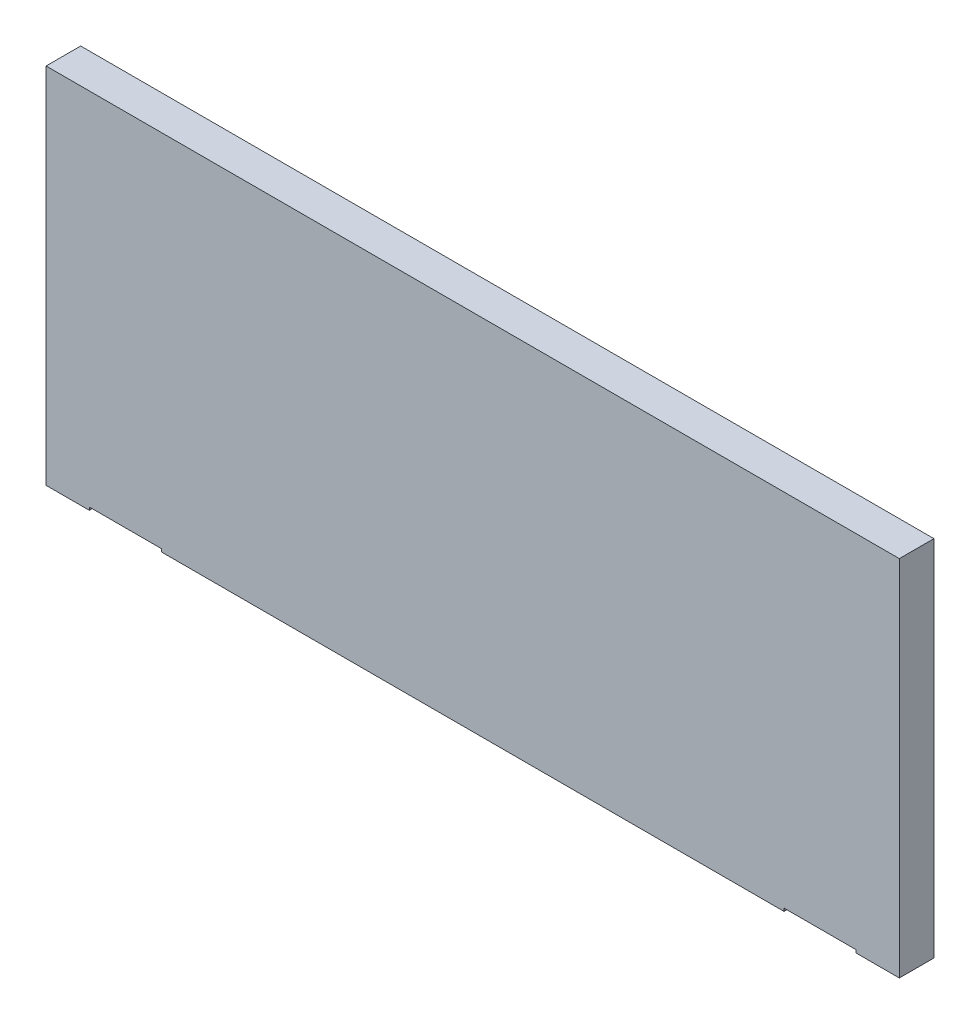
ISO-10303-21;
HEADER;
FILE_DESCRIPTION(('STEP AP214'),'2;1');
FILE_NAME('part.step','',(''),(''),'','','');
FILE_SCHEMA(('AUTOMOTIVE_DESIGN { 1 0 10303 214 1 1 1 1 }'));
ENDSEC;
DATA;
#1=APPLICATION_CONTEXT('core data for automotive mechanical design processes');
#2=APPLICATION_PROTOCOL_DEFINITION('international standard','automotive_design',2000,#1);
#3=PRODUCT_CONTEXT('',#1,'mechanical');
#4=PRODUCT('Part','Part','',(#3));
#5=PRODUCT_RELATED_PRODUCT_CATEGORY('part','',(#4));
#6=PRODUCT_DEFINITION_FORMATION('','',#4);
#7=PRODUCT_DEFINITION_CONTEXT('part definition',#1,'design');
#8=PRODUCT_DEFINITION('design','',#6,#7);
#9=PRODUCT_DEFINITION_SHAPE('','',#8);
#10=(LENGTH_UNIT() NAMED_UNIT(*) SI_UNIT(.MILLI.,.METRE.));
#11=(NAMED_UNIT(*) PLANE_ANGLE_UNIT() SI_UNIT($,.RADIAN.));
#12=(NAMED_UNIT(*) SI_UNIT($,.STERADIAN.) SOLID_ANGLE_UNIT());
#13=UNCERTAINTY_MEASURE_WITH_UNIT(LENGTH_MEASURE(1.E-05),#10,'distance_accuracy_value','');
#14=(GEOMETRIC_REPRESENTATION_CONTEXT(3) GLOBAL_UNCERTAINTY_ASSIGNED_CONTEXT((#13)) GLOBAL_UNIT_ASSIGNED_CONTEXT((#10,
#11,#12)) REPRESENTATION_CONTEXT('',''));
#15=CARTESIAN_POINT('',(0.,0.,0.));
#16=DIRECTION('',(0.,0.,1.));
#17=DIRECTION('',(1.,0.,0.));
#18=AXIS2_PLACEMENT_3D('',#15,#16,#17);
#19=CARTESIAN_POINT('',(0.,0.,12.));
#20=DIRECTION('',(0.,1.,0.));
#21=DIRECTION('',(0.,0.,1.));
#22=AXIS2_PLACEMENT_3D('',#19,#20,#21);
#23=PLANE('',#22);
#24=DIRECTION('',(0.,0.,1.));
#25=VECTOR('',#24,1.);
#26=CARTESIAN_POINT('',(256.,0.,12.));
#27=LINE('',#26,#25);
#28=CARTESIAN_POINT('',(256.,0.,0.));
#29=VERTEX_POINT('',#28);
#30=CARTESIAN_POINT('',(256.,0.,12.));
#31=VERTEX_POINT('',#30);
#32=EDGE_CURVE('E326',#29,#31,#27,.T.);
#33=ORIENTED_EDGE('',*,*,#32,.T.);
#34=DIRECTION('',(1.,0.,0.));
#35=VECTOR('',#34,1.);
#36=CARTESIAN_POINT('',(0.,0.,12.));
#37=LINE('',#36,#35);
#38=CARTESIAN_POINT('',(40.,0.,12.));
#39=VERTEX_POINT('',#38);
#40=EDGE_CURVE('E144',#39,#31,#37,.T.);
#41=ORIENTED_EDGE('',*,*,#40,.F.);
#42=DIRECTION('',(0.,0.,-1.));
#43=VECTOR('',#42,1.);
#44=CARTESIAN_POINT('',(40.,0.,12.));
#45=LINE('',#44,#43);
#46=CARTESIAN_POINT('',(40.,0.,0.));
#47=VERTEX_POINT('',#46);
#48=EDGE_CURVE('E158',#39,#47,#45,.T.);
#49=ORIENTED_EDGE('',*,*,#48,.T.);
#50=DIRECTION('',(1.,0.,0.));
#51=VECTOR('',#50,1.);
#52=CARTESIAN_POINT('',(0.,0.,0.));
#53=LINE('',#52,#51);
#54=EDGE_CURVE('E216',#47,#29,#53,.T.);
#55=ORIENTED_EDGE('',*,*,#54,.T.);
#56=EDGE_LOOP('',(#33,#41,#49,#55));
#57=FACE_BOUND('',#56,.T.);
#58=ADVANCED_FACE('F32',(#57),#23,.F.);
#59=DIRECTION('',(0.,0.,-1.));
#60=VECTOR('',#59,1.);
#61=CARTESIAN_POINT('',(281.,0.,12.));
#62=LINE('',#61,#60);
#63=CARTESIAN_POINT('',(281.,0.,12.));
#64=VERTEX_POINT('',#63);
#65=CARTESIAN_POINT('',(281.,0.,0.));
#66=VERTEX_POINT('',#65);
#67=EDGE_CURVE('E138',#64,#66,#62,.T.);
#68=ORIENTED_EDGE('',*,*,#67,.T.);
#69=CARTESIAN_POINT('',(296.,0.,0.));
#70=VERTEX_POINT('',#69);
#71=EDGE_CURVE('E211',#66,#70,#53,.T.);
#72=ORIENTED_EDGE('',*,*,#71,.T.);
#73=DIRECTION('',(0.,0.,-1.));
#74=VECTOR('',#73,1.);
#75=CARTESIAN_POINT('',(296.,0.,12.));
#76=LINE('',#75,#74);
#77=CARTESIAN_POINT('',(296.,0.,12.));
#78=VERTEX_POINT('',#77);
#79=EDGE_CURVE('E41',#78,#70,#76,.T.);
#80=ORIENTED_EDGE('',*,*,#79,.F.);
#81=EDGE_CURVE('E199',#64,#78,#37,.T.);
#82=ORIENTED_EDGE('',*,*,#81,.F.);
#83=EDGE_LOOP('',(#68,#72,#80,#82));
#84=FACE_BOUND('',#83,.T.);
#85=ADVANCED_FACE('F249',(#84),#23,.F.);
#86=CARTESIAN_POINT('',(0.,0.,12.));
#87=DIRECTION('',(0.,0.,-1.));
#88=DIRECTION('',(-1.,0.,0.));
#89=AXIS2_PLACEMENT_3D('',#86,#87,#88);
#90=PLANE('',#89);
#91=DIRECTION('',(0.,-1.,0.));
#92=VECTOR('',#91,1.);
#93=CARTESIAN_POINT('',(256.,1.,12.));
#94=LINE('',#93,#92);
#95=CARTESIAN_POINT('',(256.,1.,12.));
#96=VERTEX_POINT('',#95);
#97=EDGE_CURVE('E133',#96,#31,#94,.T.);
#98=ORIENTED_EDGE('',*,*,#97,.F.);
#99=DIRECTION('',(1.,0.,0.));
#100=VECTOR('',#99,1.);
#101=CARTESIAN_POINT('',(256.,1.,12.));
#102=LINE('',#101,#100);
#103=CARTESIAN_POINT('',(281.,1.,12.));
#104=VERTEX_POINT('',#103);
#105=EDGE_CURVE('E124',#96,#104,#102,.T.);
#106=ORIENTED_EDGE('',*,*,#105,.T.);
#107=DIRECTION('',(0.,-1.,0.));
#108=VECTOR('',#107,1.);
#109=CARTESIAN_POINT('',(281.,1.,12.));
#110=LINE('',#109,#108);
#111=EDGE_CURVE('E145',#104,#64,#110,.T.);
#112=ORIENTED_EDGE('',*,*,#111,.T.);
#113=ORIENTED_EDGE('',*,*,#81,.T.);
#114=DIRECTION('',(0.,1.,0.));
#115=VECTOR('',#114,1.);
#116=CARTESIAN_POINT('',(296.,0.,12.));
#117=LINE('',#116,#115);
#118=CARTESIAN_POINT('',(296.,126.,12.));
#119=VERTEX_POINT('',#118);
#120=EDGE_CURVE('E204',#78,#119,#117,.T.);
#121=ORIENTED_EDGE('',*,*,#120,.T.);
#122=DIRECTION('',(-1.,0.,0.));
#123=VECTOR('',#122,1.);
#124=CARTESIAN_POINT('',(0.,126.,12.));
#125=LINE('',#124,#123);
#126=CARTESIAN_POINT('',(0.,126.,12.));
#127=VERTEX_POINT('',#126);
#128=EDGE_CURVE('E206',#119,#127,#125,.T.);
#129=ORIENTED_EDGE('',*,*,#128,.T.);
#130=DIRECTION('',(0.,-1.,0.));
#131=VECTOR('',#130,1.);
#132=CARTESIAN_POINT('',(0.,0.,12.));
#133=LINE('',#132,#131);
#134=CARTESIAN_POINT('',(0.,0.,12.));
#135=VERTEX_POINT('',#134);
#136=EDGE_CURVE('E196',#127,#135,#133,.T.);
#137=ORIENTED_EDGE('',*,*,#136,.T.);
#138=CARTESIAN_POINT('',(15.,0.,12.));
#139=VERTEX_POINT('',#138);
#140=EDGE_CURVE('E201',#135,#139,#37,.T.);
#141=ORIENTED_EDGE('',*,*,#140,.T.);
#142=DIRECTION('',(0.,-1.,0.));
#143=VECTOR('',#142,1.);
#144=CARTESIAN_POINT('',(15.,1.,12.));
#145=LINE('',#144,#143);
#146=CARTESIAN_POINT('',(15.,1.,12.));
#147=VERTEX_POINT('',#146);
#148=EDGE_CURVE('E177',#147,#139,#145,.T.);
#149=ORIENTED_EDGE('',*,*,#148,.F.);
#150=DIRECTION('',(1.,0.,0.));
#151=VECTOR('',#150,1.);
#152=CARTESIAN_POINT('',(15.,1.,12.));
#153=LINE('',#152,#151);
#154=CARTESIAN_POINT('',(40.,1.,12.));
#155=VERTEX_POINT('',#154);
#156=EDGE_CURVE('E157',#147,#155,#153,.T.);
#157=ORIENTED_EDGE('',*,*,#156,.T.);
#158=DIRECTION('',(0.,-1.,0.));
#159=VECTOR('',#158,1.);
#160=CARTESIAN_POINT('',(40.,1.,12.));
#161=LINE('',#160,#159);
#162=EDGE_CURVE('E175',#155,#39,#161,.T.);
#163=ORIENTED_EDGE('',*,*,#162,.T.);
#164=ORIENTED_EDGE('',*,*,#40,.T.);
#165=EDGE_LOOP('',(#98,#106,#112,#113,#121,#129,#137,#141,#149,#157,#163,#164));
#166=FACE_BOUND('',#165,.T.);
#167=ADVANCED_FACE('F141',(#166),#90,.F.);
#168=CARTESIAN_POINT('',(0.,0.,0.));
#169=DIRECTION('',(0.,0.,-1.));
#170=DIRECTION('',(-1.,0.,0.));
#171=AXIS2_PLACEMENT_3D('',#168,#169,#170);
#172=PLANE('',#171);
#173=DIRECTION('',(-1.,0.,0.));
#174=VECTOR('',#173,1.);
#175=CARTESIAN_POINT('',(256.,1.,0.));
#176=LINE('',#175,#174);
#177=CARTESIAN_POINT('',(281.,1.,0.));
#178=VERTEX_POINT('',#177);
#179=CARTESIAN_POINT('',(256.,1.,0.));
#180=VERTEX_POINT('',#179);
#181=EDGE_CURVE('E327',#178,#180,#176,.T.);
#182=ORIENTED_EDGE('',*,*,#181,.T.);
#183=DIRECTION('',(0.,-1.,0.));
#184=VECTOR('',#183,1.);
#185=CARTESIAN_POINT('',(256.,1.,0.));
#186=LINE('',#185,#184);
#187=EDGE_CURVE('E136',#180,#29,#186,.T.);
#188=ORIENTED_EDGE('',*,*,#187,.T.);
#189=ORIENTED_EDGE('',*,*,#54,.F.);
#190=DIRECTION('',(0.,-1.,0.));
#191=VECTOR('',#190,1.);
#192=CARTESIAN_POINT('',(40.,1.,0.));
#193=LINE('',#192,#191);
#194=CARTESIAN_POINT('',(40.,1.,0.));
#195=VERTEX_POINT('',#194);
#196=EDGE_CURVE('E173',#195,#47,#193,.T.);
#197=ORIENTED_EDGE('',*,*,#196,.F.);
#198=DIRECTION('',(-1.,0.,0.));
#199=VECTOR('',#198,1.);
#200=CARTESIAN_POINT('',(15.,1.,0.));
#201=LINE('',#200,#199);
#202=CARTESIAN_POINT('',(15.,1.,0.));
#203=VERTEX_POINT('',#202);
#204=EDGE_CURVE('E163',#195,#203,#201,.T.);
#205=ORIENTED_EDGE('',*,*,#204,.T.);
#206=DIRECTION('',(0.,-1.,0.));
#207=VECTOR('',#206,1.);
#208=CARTESIAN_POINT('',(15.,1.,0.));
#209=LINE('',#208,#207);
#210=CARTESIAN_POINT('',(15.,0.,0.));
#211=VERTEX_POINT('',#210);
#212=EDGE_CURVE('E166',#203,#211,#209,.T.);
#213=ORIENTED_EDGE('',*,*,#212,.T.);
#214=CARTESIAN_POINT('',(0.,0.,0.));
#215=VERTEX_POINT('',#214);
#216=EDGE_CURVE('E212',#215,#211,#53,.T.);
#217=ORIENTED_EDGE('',*,*,#216,.F.);
#218=DIRECTION('',(0.,-1.,0.));
#219=VECTOR('',#218,1.);
#220=CARTESIAN_POINT('',(0.,0.,0.));
#221=LINE('',#220,#219);
#222=CARTESIAN_POINT('',(0.,126.,0.));
#223=VERTEX_POINT('',#222);
#224=EDGE_CURVE('E195',#223,#215,#221,.T.);
#225=ORIENTED_EDGE('',*,*,#224,.F.);
#226=DIRECTION('',(-1.,0.,0.));
#227=VECTOR('',#226,1.);
#228=CARTESIAN_POINT('',(0.,126.,0.));
#229=LINE('',#228,#227);
#230=CARTESIAN_POINT('',(296.,126.,0.));
#231=VERTEX_POINT('',#230);
#232=EDGE_CURVE('E200',#231,#223,#229,.T.);
#233=ORIENTED_EDGE('',*,*,#232,.F.);
#234=DIRECTION('',(0.,1.,0.));
#235=VECTOR('',#234,1.);
#236=CARTESIAN_POINT('',(296.,0.,0.));
#237=LINE('',#236,#235);
#238=EDGE_CURVE('E215',#70,#231,#237,.T.);
#239=ORIENTED_EDGE('',*,*,#238,.F.);
#240=ORIENTED_EDGE('',*,*,#71,.F.);
#241=DIRECTION('',(0.,-1.,0.));
#242=VECTOR('',#241,1.);
#243=CARTESIAN_POINT('',(281.,1.,0.));
#244=LINE('',#243,#242);
#245=EDGE_CURVE('E149',#178,#66,#244,.T.);
#246=ORIENTED_EDGE('',*,*,#245,.F.);
#247=EDGE_LOOP('',(#182,#188,#189,#197,#205,#213,#217,#225,#233,#239,#240,#246));
#248=FACE_BOUND('',#247,.T.);
#249=ADVANCED_FACE('F258',(#248),#172,.T.);
#250=DIRECTION('',(0.,0.,1.));
#251=VECTOR('',#250,1.);
#252=CARTESIAN_POINT('',(15.,0.,12.));
#253=LINE('',#252,#251);
#254=EDGE_CURVE('E155',#211,#139,#253,.T.);
#255=ORIENTED_EDGE('',*,*,#254,.T.);
#256=ORIENTED_EDGE('',*,*,#140,.F.);
#257=DIRECTION('',(0.,0.,-1.));
#258=VECTOR('',#257,1.);
#259=CARTESIAN_POINT('',(0.,0.,12.));
#260=LINE('',#259,#258);
#261=EDGE_CURVE('E11',#135,#215,#260,.T.);
#262=ORIENTED_EDGE('',*,*,#261,.T.);
#263=ORIENTED_EDGE('',*,*,#216,.T.);
#264=EDGE_LOOP('',(#255,#256,#262,#263));
#265=FACE_BOUND('',#264,.T.);
#266=ADVANCED_FACE('F251',(#265),#23,.F.);
#267=CARTESIAN_POINT('',(0.,0.,12.));
#268=DIRECTION('',(1.,0.,0.));
#269=DIRECTION('',(0.,0.,-1.));
#270=AXIS2_PLACEMENT_3D('',#267,#268,#269);
#271=PLANE('',#270);
#272=ORIENTED_EDGE('',*,*,#224,.T.);
#273=ORIENTED_EDGE('',*,*,#261,.F.);
#274=ORIENTED_EDGE('',*,*,#136,.F.);
#275=DIRECTION('',(0.,0.,-1.));
#276=VECTOR('',#275,1.);
#277=CARTESIAN_POINT('',(0.,126.,12.));
#278=LINE('',#277,#276);
#279=EDGE_CURVE('E208',#127,#223,#278,.T.);
#280=ORIENTED_EDGE('',*,*,#279,.T.);
#281=EDGE_LOOP('',(#272,#273,#274,#280));
#282=FACE_BOUND('',#281,.T.);
#283=ADVANCED_FACE('F34',(#282),#271,.F.);
#284=CARTESIAN_POINT('',(296.,0.,12.));
#285=DIRECTION('',(-1.,0.,0.));
#286=DIRECTION('',(0.,0.,1.));
#287=AXIS2_PLACEMENT_3D('',#284,#285,#286);
#288=PLANE('',#287);
#289=ORIENTED_EDGE('',*,*,#238,.T.);
#290=DIRECTION('',(0.,0.,-1.));
#291=VECTOR('',#290,1.);
#292=CARTESIAN_POINT('',(296.,126.,12.));
#293=LINE('',#292,#291);
#294=EDGE_CURVE('E221',#119,#231,#293,.T.);
#295=ORIENTED_EDGE('',*,*,#294,.F.);
#296=ORIENTED_EDGE('',*,*,#120,.F.);
#297=ORIENTED_EDGE('',*,*,#79,.T.);
#298=EDGE_LOOP('',(#289,#295,#296,#297));
#299=FACE_BOUND('',#298,.T.);
#300=ADVANCED_FACE('F264',(#299),#288,.F.);
#301=CARTESIAN_POINT('',(0.,126.,12.));
#302=DIRECTION('',(0.,-1.,0.));
#303=DIRECTION('',(0.,0.,-1.));
#304=AXIS2_PLACEMENT_3D('',#301,#302,#303);
#305=PLANE('',#304);
#306=ORIENTED_EDGE('',*,*,#232,.T.);
#307=ORIENTED_EDGE('',*,*,#279,.F.);
#308=ORIENTED_EDGE('',*,*,#128,.F.);
#309=ORIENTED_EDGE('',*,*,#294,.T.);
#310=EDGE_LOOP('',(#306,#307,#308,#309));
#311=FACE_BOUND('',#310,.T.);
#312=ADVANCED_FACE('F279',(#311),#305,.F.);
#313=CARTESIAN_POINT('',(15.,1.,12.));
#314=DIRECTION('',(1.,0.,0.));
#315=DIRECTION('',(0.,0.,-1.));
#316=AXIS2_PLACEMENT_3D('',#313,#314,#315);
#317=PLANE('',#316);
#318=ORIENTED_EDGE('',*,*,#254,.F.);
#319=ORIENTED_EDGE('',*,*,#212,.F.);
#320=DIRECTION('',(0.,0.,1.));
#321=VECTOR('',#320,1.);
#322=CARTESIAN_POINT('',(15.,1.,12.));
#323=LINE('',#322,#321);
#324=EDGE_CURVE('E57',#203,#147,#323,.T.);
#325=ORIENTED_EDGE('',*,*,#324,.T.);
#326=ORIENTED_EDGE('',*,*,#148,.T.);
#327=EDGE_LOOP('',(#318,#319,#325,#326));
#328=FACE_BOUND('',#327,.T.);
#329=ADVANCED_FACE('F243',(#328),#317,.T.);
#330=CARTESIAN_POINT('',(40.,1.,12.));
#331=DIRECTION('',(-1.,0.,0.));
#332=DIRECTION('',(0.,0.,1.));
#333=AXIS2_PLACEMENT_3D('',#330,#331,#332);
#334=PLANE('',#333);
#335=ORIENTED_EDGE('',*,*,#48,.F.);
#336=ORIENTED_EDGE('',*,*,#162,.F.);
#337=DIRECTION('',(0.,0.,-1.));
#338=VECTOR('',#337,1.);
#339=CARTESIAN_POINT('',(40.,1.,12.));
#340=LINE('',#339,#338);
#341=EDGE_CURVE('E161',#155,#195,#340,.T.);
#342=ORIENTED_EDGE('',*,*,#341,.T.);
#343=ORIENTED_EDGE('',*,*,#196,.T.);
#344=EDGE_LOOP('',(#335,#336,#342,#343));
#345=FACE_BOUND('',#344,.T.);
#346=ADVANCED_FACE('F233',(#345),#334,.T.);
#347=CARTESIAN_POINT('',(0.,1.,0.));
#348=DIRECTION('',(0.,-1.,0.));
#349=DIRECTION('',(0.,0.,-1.));
#350=AXIS2_PLACEMENT_3D('',#347,#348,#349);
#351=PLANE('',#350);
#352=CARTESIAN_POINT('',(21.,0.999999999999999,6.));
#353=DIRECTION('',(0.,-1.,0.));
#354=DIRECTION('',(0.,0.,-1.));
#355=AXIS2_PLACEMENT_3D('',#352,#353,#354);
#356=CIRCLE('',#355,1.5);
#357=CARTESIAN_POINT('',(21.,0.999999999999999,4.5));
#358=VERTEX_POINT('',#357);
#359=EDGE_CURVE('E180',#358,#358,#356,.T.);
#360=ORIENTED_EDGE('',*,*,#359,.F.);
#361=EDGE_LOOP('',(#360));
#362=FACE_BOUND('',#361,.T.);
#363=CARTESIAN_POINT('',(34.,0.999999999999999,6.));
#364=DIRECTION('',(0.,-1.,0.));
#365=DIRECTION('',(0.,0.,-1.));
#366=AXIS2_PLACEMENT_3D('',#363,#364,#365);
#367=CIRCLE('',#366,1.5);
#368=CARTESIAN_POINT('',(34.,0.999999999999999,4.5));
#369=VERTEX_POINT('',#368);
#370=EDGE_CURVE('E179',#369,#369,#367,.T.);
#371=ORIENTED_EDGE('',*,*,#370,.F.);
#372=EDGE_LOOP('',(#371));
#373=FACE_BOUND('',#372,.T.);
#374=ORIENTED_EDGE('',*,*,#324,.F.);
#375=ORIENTED_EDGE('',*,*,#204,.F.);
#376=ORIENTED_EDGE('',*,*,#341,.F.);
#377=ORIENTED_EDGE('',*,*,#156,.F.);
#378=EDGE_LOOP('',(#374,#375,#376,#377));
#379=FACE_BOUND('',#378,.T.);
#380=ADVANCED_FACE('F230',(#362,#373,#379),#351,.T.);
#381=CARTESIAN_POINT('',(21.,10.,6.));
#382=DIRECTION('',(0.,1.,0.));
#383=DIRECTION('',(0.,0.,1.));
#384=AXIS2_PLACEMENT_3D('',#381,#382,#383);
#385=PLANE('',#384);
#386=CARTESIAN_POINT('',(21.,10.,6.));
#387=DIRECTION('',(0.,1.,0.));
#388=DIRECTION('',(0.,0.,1.));
#389=AXIS2_PLACEMENT_3D('',#386,#387,#388);
#390=CIRCLE('',#389,1.5);
#391=CARTESIAN_POINT('',(21.,10.,7.5));
#392=VERTEX_POINT('',#391);
#393=EDGE_CURVE('E187',#392,#392,#390,.T.);
#394=ORIENTED_EDGE('',*,*,#393,.F.);
#395=EDGE_LOOP('',(#394));
#396=FACE_BOUND('',#395,.T.);
#397=ADVANCED_FACE('F232',(#396),#385,.F.);
#398=CARTESIAN_POINT('',(21.,10.,6.));
#399=DIRECTION('',(0.,-1.,0.));
#400=DIRECTION('',(0.,0.,-1.));
#401=AXIS2_PLACEMENT_3D('',#398,#399,#400);
#402=CYLINDRICAL_SURFACE('',#401,1.5);
#403=ORIENTED_EDGE('',*,*,#393,.T.);
#404=EDGE_LOOP('',(#403));
#405=FACE_BOUND('',#404,.T.);
#406=ORIENTED_EDGE('',*,*,#359,.T.);
#407=EDGE_LOOP('',(#406));
#408=FACE_BOUND('',#407,.T.);
#409=ADVANCED_FACE('F240',(#405,#408),#402,.F.);
#410=CARTESIAN_POINT('',(34.,10.,6.));
#411=DIRECTION('',(0.,1.,0.));
#412=DIRECTION('',(0.,0.,1.));
#413=AXIS2_PLACEMENT_3D('',#410,#411,#412);
#414=PLANE('',#413);
#415=CARTESIAN_POINT('',(34.,10.,6.));
#416=DIRECTION('',(0.,1.,0.));
#417=DIRECTION('',(0.,0.,1.));
#418=AXIS2_PLACEMENT_3D('',#415,#416,#417);
#419=CIRCLE('',#418,1.5);
#420=CARTESIAN_POINT('',(34.,10.,7.5));
#421=VERTEX_POINT('',#420);
#422=EDGE_CURVE('E184',#421,#421,#419,.T.);
#423=ORIENTED_EDGE('',*,*,#422,.F.);
#424=EDGE_LOOP('',(#423));
#425=FACE_BOUND('',#424,.T.);
#426=ADVANCED_FACE('F287',(#425),#414,.F.);
#427=CARTESIAN_POINT('',(34.,10.,6.));
#428=DIRECTION('',(0.,-1.,0.));
#429=DIRECTION('',(0.,0.,-1.));
#430=AXIS2_PLACEMENT_3D('',#427,#428,#429);
#431=CYLINDRICAL_SURFACE('',#430,1.5);
#432=ORIENTED_EDGE('',*,*,#422,.T.);
#433=EDGE_LOOP('',(#432));
#434=FACE_BOUND('',#433,.T.);
#435=ORIENTED_EDGE('',*,*,#370,.T.);
#436=EDGE_LOOP('',(#435));
#437=FACE_BOUND('',#436,.T.);
#438=ADVANCED_FACE('F228',(#434,#437),#431,.F.);
#439=CARTESIAN_POINT('',(256.,1.,12.));
#440=DIRECTION('',(1.,0.,0.));
#441=DIRECTION('',(0.,0.,-1.));
#442=AXIS2_PLACEMENT_3D('',#439,#440,#441);
#443=PLANE('',#442);
#444=ORIENTED_EDGE('',*,*,#32,.F.);
#445=ORIENTED_EDGE('',*,*,#187,.F.);
#446=DIRECTION('',(0.,0.,1.));
#447=VECTOR('',#446,1.);
#448=CARTESIAN_POINT('',(256.,1.,12.));
#449=LINE('',#448,#447);
#450=EDGE_CURVE('E49',#180,#96,#449,.T.);
#451=ORIENTED_EDGE('',*,*,#450,.T.);
#452=ORIENTED_EDGE('',*,*,#97,.T.);
#453=EDGE_LOOP('',(#444,#445,#451,#452));
#454=FACE_BOUND('',#453,.T.);
#455=ADVANCED_FACE('F132',(#454),#443,.T.);
#456=CARTESIAN_POINT('',(281.,1.,12.));
#457=DIRECTION('',(-1.,0.,0.));
#458=DIRECTION('',(0.,0.,1.));
#459=AXIS2_PLACEMENT_3D('',#456,#457,#458);
#460=PLANE('',#459);
#461=ORIENTED_EDGE('',*,*,#67,.F.);
#462=ORIENTED_EDGE('',*,*,#111,.F.);
#463=DIRECTION('',(0.,0.,-1.));
#464=VECTOR('',#463,1.);
#465=CARTESIAN_POINT('',(281.,1.,12.));
#466=LINE('',#465,#464);
#467=EDGE_CURVE('E126',#104,#178,#466,.T.);
#468=ORIENTED_EDGE('',*,*,#467,.T.);
#469=ORIENTED_EDGE('',*,*,#245,.T.);
#470=EDGE_LOOP('',(#461,#462,#468,#469));
#471=FACE_BOUND('',#470,.T.);
#472=ADVANCED_FACE('F334',(#471),#460,.T.);
#473=CARTESIAN_POINT('',(0.,1.,0.));
#474=DIRECTION('',(0.,-1.,0.));
#475=DIRECTION('',(0.,0.,-1.));
#476=AXIS2_PLACEMENT_3D('',#473,#474,#475);
#477=PLANE('',#476);
#478=CARTESIAN_POINT('',(262.,0.999999999999999,6.));
#479=DIRECTION('',(0.,-1.,0.));
#480=DIRECTION('',(0.,0.,-1.));
#481=AXIS2_PLACEMENT_3D('',#478,#479,#480);
#482=CIRCLE('',#481,1.50000000000002);
#483=CARTESIAN_POINT('',(262.,0.999999999999999,4.49999999999998));
#484=VERTEX_POINT('',#483);
#485=EDGE_CURVE('E148',#484,#484,#482,.T.);
#486=ORIENTED_EDGE('',*,*,#485,.F.);
#487=EDGE_LOOP('',(#486));
#488=FACE_BOUND('',#487,.T.);
#489=CARTESIAN_POINT('',(275.,0.999999999999999,6.));
#490=DIRECTION('',(0.,-1.,0.));
#491=DIRECTION('',(0.,0.,-1.));
#492=AXIS2_PLACEMENT_3D('',#489,#490,#491);
#493=CIRCLE('',#492,1.50000000000002);
#494=CARTESIAN_POINT('',(275.,0.999999999999999,4.49999999999998));
#495=VERTEX_POINT('',#494);
#496=EDGE_CURVE('E36',#495,#495,#493,.T.);
#497=ORIENTED_EDGE('',*,*,#496,.F.);
#498=EDGE_LOOP('',(#497));
#499=FACE_BOUND('',#498,.T.);
#500=ORIENTED_EDGE('',*,*,#450,.F.);
#501=ORIENTED_EDGE('',*,*,#181,.F.);
#502=ORIENTED_EDGE('',*,*,#467,.F.);
#503=ORIENTED_EDGE('',*,*,#105,.F.);
#504=EDGE_LOOP('',(#500,#501,#502,#503));
#505=FACE_BOUND('',#504,.T.);
#506=ADVANCED_FACE('F125',(#488,#499,#505),#477,.T.);
#507=CARTESIAN_POINT('',(262.,10.,6.));
#508=DIRECTION('',(0.,1.,0.));
#509=DIRECTION('',(0.,0.,1.));
#510=AXIS2_PLACEMENT_3D('',#507,#508,#509);
#511=PLANE('',#510);
#512=CARTESIAN_POINT('',(262.,10.,6.));
#513=DIRECTION('',(0.,1.,0.));
#514=DIRECTION('',(0.,0.,1.));
#515=AXIS2_PLACEMENT_3D('',#512,#513,#514);
#516=CIRCLE('',#515,1.50000000000002);
#517=CARTESIAN_POINT('',(262.,10.,7.50000000000002));
#518=VERTEX_POINT('',#517);
#519=EDGE_CURVE('E183',#518,#518,#516,.T.);
#520=ORIENTED_EDGE('',*,*,#519,.F.);
#521=EDGE_LOOP('',(#520));
#522=FACE_BOUND('',#521,.T.);
#523=ADVANCED_FACE('F303',(#522),#511,.F.);
#524=CARTESIAN_POINT('',(262.,10.,6.));
#525=DIRECTION('',(0.,-1.,0.));
#526=DIRECTION('',(0.,0.,-1.));
#527=AXIS2_PLACEMENT_3D('',#524,#525,#526);
#528=CYLINDRICAL_SURFACE('',#527,1.50000000000002);
#529=ORIENTED_EDGE('',*,*,#519,.T.);
#530=EDGE_LOOP('',(#529));
#531=FACE_BOUND('',#530,.T.);
#532=ORIENTED_EDGE('',*,*,#485,.T.);
#533=EDGE_LOOP('',(#532));
#534=FACE_BOUND('',#533,.T.);
#535=ADVANCED_FACE('F298',(#531,#534),#528,.F.);
#536=CARTESIAN_POINT('',(275.,10.,6.));
#537=DIRECTION('',(0.,1.,0.));
#538=DIRECTION('',(0.,0.,1.));
#539=AXIS2_PLACEMENT_3D('',#536,#537,#538);
#540=PLANE('',#539);
#541=CARTESIAN_POINT('',(275.,10.,6.));
#542=DIRECTION('',(0.,1.,0.));
#543=DIRECTION('',(0.,0.,1.));
#544=AXIS2_PLACEMENT_3D('',#541,#542,#543);
#545=CIRCLE('',#544,1.50000000000002);
#546=CARTESIAN_POINT('',(275.,10.,7.50000000000002));
#547=VERTEX_POINT('',#546);
#548=EDGE_CURVE('E188',#547,#547,#545,.T.);
#549=ORIENTED_EDGE('',*,*,#548,.F.);
#550=EDGE_LOOP('',(#549));
#551=FACE_BOUND('',#550,.T.);
#552=ADVANCED_FACE('F294',(#551),#540,.F.);
#553=CARTESIAN_POINT('',(275.,10.,6.));
#554=DIRECTION('',(0.,-1.,0.));
#555=DIRECTION('',(0.,0.,-1.));
#556=AXIS2_PLACEMENT_3D('',#553,#554,#555);
#557=CYLINDRICAL_SURFACE('',#556,1.50000000000002);
#558=ORIENTED_EDGE('',*,*,#548,.T.);
#559=EDGE_LOOP('',(#558));
#560=FACE_BOUND('',#559,.T.);
#561=ORIENTED_EDGE('',*,*,#496,.T.);
#562=EDGE_LOOP('',(#561));
#563=FACE_BOUND('',#562,.T.);
#564=ADVANCED_FACE('F297',(#560,#563),#557,.F.);
#565=CLOSED_SHELL('',(#58,#85,#167,#249,#266,#283,#300,#312,#329,#346,#380,#397,#409,#426,#438,
#455,#472,#506,#523,#535,#552,#564));
#566=MANIFOLD_SOLID_BREP('B2',#565);
#567=ADVANCED_BREP_SHAPE_REPRESENTATION('',(#18,#566),#14);
#568=SHAPE_DEFINITION_REPRESENTATION(#9,#567);
ENDSEC;
END-ISO-10303-21;
